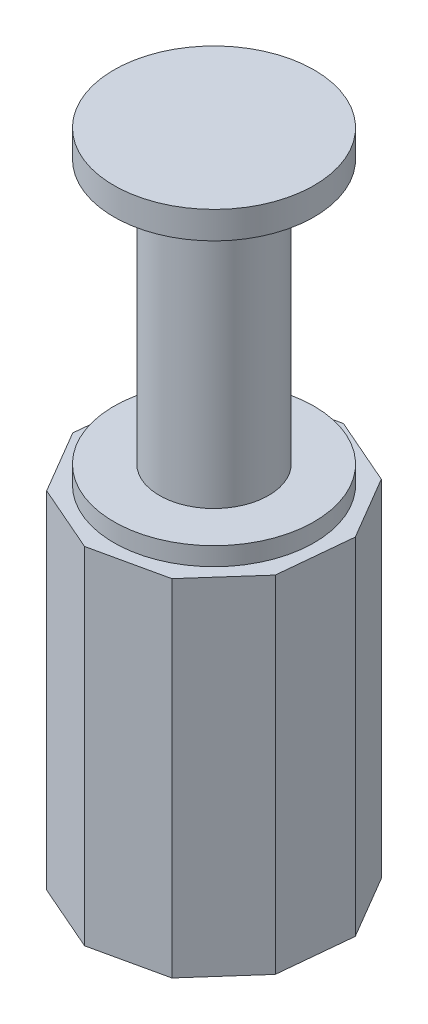
ISO-10303-21;
HEADER;
FILE_DESCRIPTION(('STEP AP214'),'2;1');
FILE_NAME('part.step','',(''),(''),'','','');
FILE_SCHEMA(('AUTOMOTIVE_DESIGN { 1 0 10303 214 1 1 1 1 }'));
ENDSEC;
DATA;
#1=APPLICATION_CONTEXT('core data for automotive mechanical design processes');
#2=APPLICATION_PROTOCOL_DEFINITION('international standard','automotive_design',2000,#1);
#3=PRODUCT_CONTEXT('',#1,'mechanical');
#4=PRODUCT('Part','Part','',(#3));
#5=PRODUCT_RELATED_PRODUCT_CATEGORY('part','',(#4));
#6=PRODUCT_DEFINITION_FORMATION('','',#4);
#7=PRODUCT_DEFINITION_CONTEXT('part definition',#1,'design');
#8=PRODUCT_DEFINITION('design','',#6,#7);
#9=PRODUCT_DEFINITION_SHAPE('','',#8);
#10=(LENGTH_UNIT() NAMED_UNIT(*) SI_UNIT(.MILLI.,.METRE.));
#11=(NAMED_UNIT(*) PLANE_ANGLE_UNIT() SI_UNIT($,.RADIAN.));
#12=(NAMED_UNIT(*) SI_UNIT($,.STERADIAN.) SOLID_ANGLE_UNIT());
#13=UNCERTAINTY_MEASURE_WITH_UNIT(LENGTH_MEASURE(1.E-05),#10,'distance_accuracy_value','');
#14=(GEOMETRIC_REPRESENTATION_CONTEXT(3) GLOBAL_UNCERTAINTY_ASSIGNED_CONTEXT((#13)) GLOBAL_UNIT_ASSIGNED_CONTEXT((#10,
#11,#12)) REPRESENTATION_CONTEXT('',''));
#15=CARTESIAN_POINT('',(0.,0.,0.));
#16=DIRECTION('',(0.,0.,1.));
#17=DIRECTION('',(1.,0.,0.));
#18=AXIS2_PLACEMENT_3D('',#15,#16,#17);
#19=CARTESIAN_POINT('',(0.,-61.7011854285916,0.));
#20=DIRECTION('',(0.,-1.,0.));
#21=DIRECTION('',(0.,0.,-1.));
#22=AXIS2_PLACEMENT_3D('',#19,#20,#21);
#23=CYLINDRICAL_SURFACE('',#22,55.);
#24=CARTESIAN_POINT('',(0.,9.99999999999999,0.));
#25=DIRECTION('',(0.,-1.,0.));
#26=DIRECTION('',(0.,0.,-1.));
#27=AXIS2_PLACEMENT_3D('',#24,#25,#26);
#28=CIRCLE('',#27,55.);
#29=CARTESIAN_POINT('',(0.,9.99999999999999,-55.));
#30=VERTEX_POINT('',#29);
#31=EDGE_CURVE('E44',#30,#30,#28,.T.);
#32=ORIENTED_EDGE('',*,*,#31,.T.);
#33=EDGE_LOOP('',(#32));
#34=FACE_BOUND('',#33,.T.);
#35=CARTESIAN_POINT('',(0.,0.,0.));
#36=DIRECTION('',(0.,-1.,0.));
#37=DIRECTION('',(0.,0.,-1.));
#38=AXIS2_PLACEMENT_3D('',#35,#36,#37);
#39=CIRCLE('',#38,55.);
#40=CARTESIAN_POINT('',(0.,0.,-55.));
#41=VERTEX_POINT('',#40);
#42=EDGE_CURVE('E11',#41,#41,#39,.T.);
#43=ORIENTED_EDGE('',*,*,#42,.F.);
#44=EDGE_LOOP('',(#43));
#45=FACE_BOUND('',#44,.T.);
#46=ADVANCED_FACE('F36',(#34,#45),#23,.T.);
#47=CARTESIAN_POINT('',(0.,10.,-55.));
#48=DIRECTION('',(0.,1.,0.));
#49=DIRECTION('',(0.,0.,1.));
#50=AXIS2_PLACEMENT_3D('',#47,#48,#49);
#51=PLANE('',#50);
#52=CARTESIAN_POINT('',(0.,9.99999999999999,0.));
#53=DIRECTION('',(0.,-1.,0.));
#54=DIRECTION('',(0.,0.,-1.));
#55=AXIS2_PLACEMENT_3D('',#52,#53,#54);
#56=CIRCLE('',#55,30.);
#57=CARTESIAN_POINT('',(0.,9.99999999999999,-30.));
#58=VERTEX_POINT('',#57);
#59=EDGE_CURVE('E193',#58,#58,#56,.T.);
#60=ORIENTED_EDGE('',*,*,#59,.T.);
#61=EDGE_LOOP('',(#60));
#62=FACE_BOUND('',#61,.T.);
#63=ORIENTED_EDGE('',*,*,#31,.F.);
#64=EDGE_LOOP('',(#63));
#65=FACE_BOUND('',#64,.T.);
#66=ADVANCED_FACE('F200',(#62,#65),#51,.T.);
#67=CARTESIAN_POINT('',(0.,-61.7011854285916,0.));
#68=DIRECTION('',(0.,-1.,0.));
#69=DIRECTION('',(0.,0.,-1.));
#70=AXIS2_PLACEMENT_3D('',#67,#68,#69);
#71=CYLINDRICAL_SURFACE('',#70,30.);
#72=CARTESIAN_POINT('',(0.,155.,0.));
#73=DIRECTION('',(0.,-1.,0.));
#74=DIRECTION('',(0.,0.,-1.));
#75=AXIS2_PLACEMENT_3D('',#72,#73,#74);
#76=CIRCLE('',#75,30.);
#77=CARTESIAN_POINT('',(0.,155.,-30.));
#78=VERTEX_POINT('',#77);
#79=EDGE_CURVE('E190',#78,#78,#76,.T.);
#80=ORIENTED_EDGE('',*,*,#79,.T.);
#81=EDGE_LOOP('',(#80));
#82=FACE_BOUND('',#81,.T.);
#83=ORIENTED_EDGE('',*,*,#59,.F.);
#84=EDGE_LOOP('',(#83));
#85=FACE_BOUND('',#84,.T.);
#86=ADVANCED_FACE('F202',(#82,#85),#71,.T.);
#87=CARTESIAN_POINT('',(0.,155.,-30.));
#88=DIRECTION('',(0.,-1.,0.));
#89=DIRECTION('',(0.,0.,-1.));
#90=AXIS2_PLACEMENT_3D('',#87,#88,#89);
#91=PLANE('',#90);
#92=CARTESIAN_POINT('',(0.,155.,0.));
#93=DIRECTION('',(0.,-1.,0.));
#94=DIRECTION('',(0.,0.,-1.));
#95=AXIS2_PLACEMENT_3D('',#92,#93,#94);
#96=CIRCLE('',#95,55.);
#97=CARTESIAN_POINT('',(0.,155.,-55.));
#98=VERTEX_POINT('',#97);
#99=EDGE_CURVE('E187',#98,#98,#96,.T.);
#100=ORIENTED_EDGE('',*,*,#99,.T.);
#101=EDGE_LOOP('',(#100));
#102=FACE_BOUND('',#101,.T.);
#103=ORIENTED_EDGE('',*,*,#79,.F.);
#104=EDGE_LOOP('',(#103));
#105=FACE_BOUND('',#104,.T.);
#106=ADVANCED_FACE('F208',(#102,#105),#91,.T.);
#107=CARTESIAN_POINT('',(0.,-61.7011854285916,0.));
#108=DIRECTION('',(0.,-1.,0.));
#109=DIRECTION('',(0.,0.,-1.));
#110=AXIS2_PLACEMENT_3D('',#107,#108,#109);
#111=CYLINDRICAL_SURFACE('',#110,55.);
#112=CARTESIAN_POINT('',(0.,170.,0.));
#113=DIRECTION('',(0.,-1.,0.));
#114=DIRECTION('',(0.,0.,-1.));
#115=AXIS2_PLACEMENT_3D('',#112,#113,#114);
#116=CIRCLE('',#115,55.);
#117=CARTESIAN_POINT('',(0.,170.,-55.));
#118=VERTEX_POINT('',#117);
#119=EDGE_CURVE('E184',#118,#118,#116,.T.);
#120=ORIENTED_EDGE('',*,*,#119,.T.);
#121=EDGE_LOOP('',(#120));
#122=FACE_BOUND('',#121,.T.);
#123=ORIENTED_EDGE('',*,*,#99,.F.);
#124=EDGE_LOOP('',(#123));
#125=FACE_BOUND('',#124,.T.);
#126=ADVANCED_FACE('F214',(#122,#125),#111,.T.);
#127=CARTESIAN_POINT('',(0.,170.,-55.));
#128=DIRECTION('',(0.,1.,0.));
#129=DIRECTION('',(0.,0.,1.));
#130=AXIS2_PLACEMENT_3D('',#127,#128,#129);
#131=PLANE('',#130);
#132=ORIENTED_EDGE('',*,*,#119,.F.);
#133=EDGE_LOOP('',(#132));
#134=FACE_BOUND('',#133,.T.);
#135=ADVANCED_FACE('F218',(#134),#131,.T.);
#136=CARTESIAN_POINT('',(63.5797171035183,-190.,-14.0255086317062));
#137=DIRECTION('',(-0.995295372339364,0.,-0.0968871601392408));
#138=DIRECTION('',(-0.0968871601392408,0.,0.995295372339364));
#139=AXIS2_PLACEMENT_3D('',#136,#137,#138);
#140=PLANE('',#139);
#141=DIRECTION('',(-0.0968871601392408,0.,0.995295372339364));
#142=VECTOR('',#141,1.);
#143=CARTESIAN_POINT('',(63.5797171035183,0.,-14.0255086317062));
#144=LINE('',#143,#142);
#145=CARTESIAN_POINT('',(63.5797171035183,0.,-14.0255086317062));
#146=VERTEX_POINT('',#145);
#147=CARTESIAN_POINT('',(59.6810587639155,0.,26.0243452205728));
#148=VERTEX_POINT('',#147);
#149=EDGE_CURVE('E145',#146,#148,#144,.T.);
#150=ORIENTED_EDGE('',*,*,#149,.T.);
#151=DIRECTION('',(0.,1.,0.));
#152=VECTOR('',#151,1.);
#153=CARTESIAN_POINT('',(59.6810587639155,-190.,26.0243452205728));
#154=LINE('',#153,#152);
#155=CARTESIAN_POINT('',(59.6810587639155,-190.,26.0243452205728));
#156=VERTEX_POINT('',#155);
#157=EDGE_CURVE('E182',#156,#148,#154,.T.);
#158=ORIENTED_EDGE('',*,*,#157,.F.);
#159=DIRECTION('',(-0.0968871601392408,0.,0.995295372339364));
#160=VECTOR('',#159,1.);
#161=CARTESIAN_POINT('',(63.5797171035183,-190.,-14.0255086317062));
#162=LINE('',#161,#160);
#163=CARTESIAN_POINT('',(63.5797171035183,-190.,-14.0255086317062));
#164=VERTEX_POINT('',#163);
#165=EDGE_CURVE('E163',#164,#156,#162,.T.);
#166=ORIENTED_EDGE('',*,*,#165,.F.);
#167=DIRECTION('',(0.,1.,0.));
#168=VECTOR('',#167,1.);
#169=CARTESIAN_POINT('',(63.5797171035183,-190.,-14.0255086317062));
#170=LINE('',#169,#168);
#171=EDGE_CURVE('E141',#164,#146,#170,.T.);
#172=ORIENTED_EDGE('',*,*,#171,.T.);
#173=EDGE_LOOP('',(#150,#158,#166,#172));
#174=FACE_BOUND('',#173,.T.);
#175=ADVANCED_FACE('F222',(#174),#140,.F.);
#176=CARTESIAN_POINT('',(59.6810587639155,-190.,26.0243452205728));
#177=DIRECTION('',(-0.748262026778941,0.,-0.663403300625397));
#178=DIRECTION('',(-0.663403300625397,0.,0.748262026778941));
#179=AXIS2_PLACEMENT_3D('',#176,#177,#178);
#180=PLANE('',#179);
#181=DIRECTION('',(-0.663403300625397,0.,0.748262026778941));
#182=VECTOR('',#181,1.);
#183=CARTESIAN_POINT('',(59.6810587639155,0.,26.0243452205728));
#184=LINE('',#183,#182);
#185=CARTESIAN_POINT('',(32.9862644610768,0.,56.1337837335538));
#186=VERTEX_POINT('',#185);
#187=EDGE_CURVE('E148',#148,#186,#184,.T.);
#188=ORIENTED_EDGE('',*,*,#187,.T.);
#189=DIRECTION('',(0.,1.,0.));
#190=VECTOR('',#189,1.);
#191=CARTESIAN_POINT('',(32.9862644610768,-190.,56.1337837335538));
#192=LINE('',#191,#190);
#193=CARTESIAN_POINT('',(32.9862644610768,-190.,56.1337837335538));
#194=VERTEX_POINT('',#193);
#195=EDGE_CURVE('E179',#194,#186,#192,.T.);
#196=ORIENTED_EDGE('',*,*,#195,.F.);
#197=DIRECTION('',(-0.663403300625397,0.,0.748262026778941));
#198=VECTOR('',#197,1.);
#199=CARTESIAN_POINT('',(59.6810587639155,-190.,26.0243452205728));
#200=LINE('',#199,#198);
#201=EDGE_CURVE('E102',#156,#194,#200,.T.);
#202=ORIENTED_EDGE('',*,*,#201,.F.);
#203=ORIENTED_EDGE('',*,*,#157,.T.);
#204=EDGE_LOOP('',(#188,#196,#202,#203));
#205=FACE_BOUND('',#204,.T.);
#206=ADVANCED_FACE('F226',(#205),#180,.F.);
#207=CARTESIAN_POINT('',(32.9862644610768,-190.,56.1337837335538));
#208=DIRECTION('',(-0.215418019479847,0.,-0.976521928521516));
#209=DIRECTION('',(-0.976521928521516,0.,0.215418019479847));
#210=AXIS2_PLACEMENT_3D('',#207,#208,#209);
#211=PLANE('',#210);
#212=DIRECTION('',(-0.976521928521516,0.,0.215418019479847));
#213=VECTOR('',#212,1.);
#214=CARTESIAN_POINT('',(32.9862644610768,0.,56.1337837335538));
#215=LINE('',#214,#213);
#216=CARTESIAN_POINT('',(-6.30816170400058,0.,64.8020247774532));
#217=VERTEX_POINT('',#216);
#218=EDGE_CURVE('E150',#186,#217,#215,.T.);
#219=ORIENTED_EDGE('',*,*,#218,.T.);
#220=DIRECTION('',(0.,1.,0.));
#221=VECTOR('',#220,1.);
#222=CARTESIAN_POINT('',(-6.30816170400058,-190.,64.8020247774532));
#223=LINE('',#222,#221);
#224=CARTESIAN_POINT('',(-6.30816170400058,-190.,64.8020247774532));
#225=VERTEX_POINT('',#224);
#226=EDGE_CURVE('E176',#225,#217,#223,.T.);
#227=ORIENTED_EDGE('',*,*,#226,.F.);
#228=DIRECTION('',(-0.976521928521516,0.,0.215418019479847));
#229=VECTOR('',#228,1.);
#230=CARTESIAN_POINT('',(32.9862644610768,-190.,56.1337837335538));
#231=LINE('',#230,#229);
#232=EDGE_CURVE('E377',#194,#225,#231,.T.);
#233=ORIENTED_EDGE('',*,*,#232,.F.);
#234=ORIENTED_EDGE('',*,*,#195,.T.);
#235=EDGE_LOOP('',(#219,#227,#233,#234));
#236=FACE_BOUND('',#235,.T.);
#237=ADVANCED_FACE('F230',(#236),#211,.F.);
#238=CARTESIAN_POINT('',(-6.30816170400058,-190.,64.8020247774532));
#239=DIRECTION('',(0.399708349471362,0.,-0.916642370482011));
#240=DIRECTION('',(-0.916642370482011,0.,-0.399708349471362));
#241=AXIS2_PLACEMENT_3D('',#238,#239,#240);
#242=PLANE('',#241);
#243=DIRECTION('',(-0.916642370482011,0.,-0.399708349471362));
#244=VECTOR('',#243,1.);
#245=CARTESIAN_POINT('',(-6.30816170400058,0.,64.8020247774532));
#246=LINE('',#245,#244);
#247=CARTESIAN_POINT('',(-43.1930845046801,0.,48.7180948961784));
#248=VERTEX_POINT('',#247);
#249=EDGE_CURVE('E152',#217,#248,#246,.T.);
#250=ORIENTED_EDGE('',*,*,#249,.T.);
#251=DIRECTION('',(0.,1.,0.));
#252=VECTOR('',#251,1.);
#253=CARTESIAN_POINT('',(-43.1930845046801,-190.,48.7180948961784));
#254=LINE('',#253,#252);
#255=CARTESIAN_POINT('',(-43.1930845046801,-190.,48.7180948961784));
#256=VERTEX_POINT('',#255);
#257=EDGE_CURVE('E173',#256,#248,#254,.T.);
#258=ORIENTED_EDGE('',*,*,#257,.F.);
#259=DIRECTION('',(-0.916642370482011,0.,-0.399708349471362));
#260=VECTOR('',#259,1.);
#261=CARTESIAN_POINT('',(-6.30816170400058,-190.,64.8020247774532));
#262=LINE('',#261,#260);
#263=EDGE_CURVE('E381',#225,#256,#262,.T.);
#264=ORIENTED_EDGE('',*,*,#263,.F.);
#265=ORIENTED_EDGE('',*,*,#226,.T.);
#266=EDGE_LOOP('',(#250,#258,#264,#265));
#267=FACE_BOUND('',#266,.T.);
#268=ADVANCED_FACE('F233',(#267),#242,.F.);
#269=CARTESIAN_POINT('',(-43.1930845046801,-190.,48.7180948961784));
#270=DIRECTION('',(0.862159714511631,0.,-0.506636582446651));
#271=DIRECTION('',(-0.506636582446651,0.,-0.862159714511631));
#272=AXIS2_PLACEMENT_3D('',#269,#270,#271);
#273=PLANE('',#272);
#274=DIRECTION('',(-0.506636582446651,0.,-0.862159714511632));
#275=VECTOR('',#274,1.);
#276=CARTESIAN_POINT('',(-43.1930845046801,0.,48.7180948961784));
#277=LINE('',#276,#275);
#278=CARTESIAN_POINT('',(-63.5797171035183,0.,14.0255086317062));
#279=VERTEX_POINT('',#278);
#280=EDGE_CURVE('E154',#248,#279,#277,.T.);
#281=ORIENTED_EDGE('',*,*,#280,.T.);
#282=DIRECTION('',(0.,1.,0.));
#283=VECTOR('',#282,1.);
#284=CARTESIAN_POINT('',(-63.5797171035183,-190.,14.0255086317062));
#285=LINE('',#284,#283);
#286=CARTESIAN_POINT('',(-63.5797171035183,-190.,14.0255086317062));
#287=VERTEX_POINT('',#286);
#288=EDGE_CURVE('E170',#287,#279,#285,.T.);
#289=ORIENTED_EDGE('',*,*,#288,.F.);
#290=DIRECTION('',(-0.506636582446651,0.,-0.862159714511632));
#291=VECTOR('',#290,1.);
#292=CARTESIAN_POINT('',(-43.1930845046801,-190.,48.7180948961784));
#293=LINE('',#292,#291);
#294=EDGE_CURVE('E383',#256,#287,#293,.T.);
#295=ORIENTED_EDGE('',*,*,#294,.F.);
#296=ORIENTED_EDGE('',*,*,#257,.T.);
#297=EDGE_LOOP('',(#281,#289,#295,#296));
#298=FACE_BOUND('',#297,.T.);
#299=ADVANCED_FACE('F237',(#298),#273,.F.);
#300=CARTESIAN_POINT('',(-63.5797171035183,-190.,14.0255086317062));
#301=DIRECTION('',(0.995295372339364,0.,0.0968871601392407));
#302=DIRECTION('',(0.0968871601392407,0.,-0.995295372339364));
#303=AXIS2_PLACEMENT_3D('',#300,#301,#302);
#304=PLANE('',#303);
#305=DIRECTION('',(0.0968871601392407,0.,-0.995295372339364));
#306=VECTOR('',#305,1.);
#307=CARTESIAN_POINT('',(-63.5797171035183,0.,14.0255086317062));
#308=LINE('',#307,#306);
#309=CARTESIAN_POINT('',(-59.6810587639155,0.,-26.0243452205727));
#310=VERTEX_POINT('',#309);
#311=EDGE_CURVE('E156',#279,#310,#308,.T.);
#312=ORIENTED_EDGE('',*,*,#311,.T.);
#313=DIRECTION('',(0.,1.,0.));
#314=VECTOR('',#313,1.);
#315=CARTESIAN_POINT('',(-59.6810587639155,-190.,-26.0243452205727));
#316=LINE('',#315,#314);
#317=CARTESIAN_POINT('',(-59.6810587639155,-190.,-26.0243452205727));
#318=VERTEX_POINT('',#317);
#319=EDGE_CURVE('E167',#318,#310,#316,.T.);
#320=ORIENTED_EDGE('',*,*,#319,.F.);
#321=DIRECTION('',(0.0968871601392407,0.,-0.995295372339364));
#322=VECTOR('',#321,1.);
#323=CARTESIAN_POINT('',(-63.5797171035183,-190.,14.0255086317062));
#324=LINE('',#323,#322);
#325=EDGE_CURVE('E385',#287,#318,#324,.T.);
#326=ORIENTED_EDGE('',*,*,#325,.F.);
#327=ORIENTED_EDGE('',*,*,#288,.T.);
#328=EDGE_LOOP('',(#312,#320,#326,#327));
#329=FACE_BOUND('',#328,.T.);
#330=ADVANCED_FACE('F241',(#329),#304,.F.);
#331=CARTESIAN_POINT('',(-59.6810587639155,-190.,-26.0243452205727));
#332=DIRECTION('',(0.748262026778941,0.,0.663403300625397));
#333=DIRECTION('',(0.663403300625397,0.,-0.748262026778941));
#334=AXIS2_PLACEMENT_3D('',#331,#332,#333);
#335=PLANE('',#334);
#336=DIRECTION('',(0.663403300625397,0.,-0.748262026778941));
#337=VECTOR('',#336,1.);
#338=CARTESIAN_POINT('',(-59.6810587639155,0.,-26.0243452205727));
#339=LINE('',#338,#337);
#340=CARTESIAN_POINT('',(-32.9862644610767,0.,-56.1337837335538));
#341=VERTEX_POINT('',#340);
#342=EDGE_CURVE('E158',#310,#341,#339,.T.);
#343=ORIENTED_EDGE('',*,*,#342,.T.);
#344=DIRECTION('',(0.,1.,0.));
#345=VECTOR('',#344,1.);
#346=CARTESIAN_POINT('',(-32.9862644610767,-190.,-56.1337837335538));
#347=LINE('',#346,#345);
#348=CARTESIAN_POINT('',(-32.9862644610767,-190.,-56.1337837335538));
#349=VERTEX_POINT('',#348);
#350=EDGE_CURVE('E136',#349,#341,#347,.T.);
#351=ORIENTED_EDGE('',*,*,#350,.F.);
#352=DIRECTION('',(0.663403300625397,0.,-0.748262026778941));
#353=VECTOR('',#352,1.);
#354=CARTESIAN_POINT('',(-59.6810587639155,-190.,-26.0243452205727));
#355=LINE('',#354,#353);
#356=EDGE_CURVE('E127',#318,#349,#355,.T.);
#357=ORIENTED_EDGE('',*,*,#356,.F.);
#358=ORIENTED_EDGE('',*,*,#319,.T.);
#359=EDGE_LOOP('',(#343,#351,#357,#358));
#360=FACE_BOUND('',#359,.T.);
#361=ADVANCED_FACE('F245',(#360),#335,.F.);
#362=CARTESIAN_POINT('',(-32.9862644610767,-190.,-56.1337837335538));
#363=DIRECTION('',(0.215418019479847,0.,0.976521928521516));
#364=DIRECTION('',(0.976521928521516,0.,-0.215418019479847));
#365=AXIS2_PLACEMENT_3D('',#362,#363,#364);
#366=PLANE('',#365);
#367=DIRECTION('',(0.976521928521516,0.,-0.215418019479847));
#368=VECTOR('',#367,1.);
#369=CARTESIAN_POINT('',(-32.9862644610767,0.,-56.1337837335538));
#370=LINE('',#369,#368);
#371=CARTESIAN_POINT('',(6.30816170400057,0.,-64.8020247774532));
#372=VERTEX_POINT('',#371);
#373=EDGE_CURVE('E135',#341,#372,#370,.T.);
#374=ORIENTED_EDGE('',*,*,#373,.T.);
#375=DIRECTION('',(0.,1.,0.));
#376=VECTOR('',#375,1.);
#377=CARTESIAN_POINT('',(6.30816170400057,-190.,-64.8020247774532));
#378=LINE('',#377,#376);
#379=CARTESIAN_POINT('',(6.30816170400057,-190.,-64.8020247774532));
#380=VERTEX_POINT('',#379);
#381=EDGE_CURVE('E132',#380,#372,#378,.T.);
#382=ORIENTED_EDGE('',*,*,#381,.F.);
#383=DIRECTION('',(0.976521928521516,0.,-0.215418019479847));
#384=VECTOR('',#383,1.);
#385=CARTESIAN_POINT('',(-32.9862644610767,-190.,-56.1337837335538));
#386=LINE('',#385,#384);
#387=EDGE_CURVE('E121',#349,#380,#386,.T.);
#388=ORIENTED_EDGE('',*,*,#387,.F.);
#389=ORIENTED_EDGE('',*,*,#350,.T.);
#390=EDGE_LOOP('',(#374,#382,#388,#389));
#391=FACE_BOUND('',#390,.T.);
#392=ADVANCED_FACE('F133',(#391),#366,.F.);
#393=CARTESIAN_POINT('',(6.30816170400057,-190.,-64.8020247774532));
#394=DIRECTION('',(-0.399708349471362,0.,0.916642370482011));
#395=DIRECTION('',(0.916642370482011,0.,0.399708349471362));
#396=AXIS2_PLACEMENT_3D('',#393,#394,#395);
#397=PLANE('',#396);
#398=DIRECTION('',(0.916642370482011,0.,0.399708349471362));
#399=VECTOR('',#398,1.);
#400=CARTESIAN_POINT('',(6.30816170400057,0.,-64.8020247774532));
#401=LINE('',#400,#399);
#402=CARTESIAN_POINT('',(43.1930845046801,0.,-48.7180948961784));
#403=VERTEX_POINT('',#402);
#404=EDGE_CURVE('E87',#372,#403,#401,.T.);
#405=ORIENTED_EDGE('',*,*,#404,.T.);
#406=DIRECTION('',(0.,1.,0.));
#407=VECTOR('',#406,1.);
#408=CARTESIAN_POINT('',(43.1930845046801,-190.,-48.7180948961784));
#409=LINE('',#408,#407);
#410=CARTESIAN_POINT('',(43.1930845046801,-190.,-48.7180948961784));
#411=VERTEX_POINT('',#410);
#412=EDGE_CURVE('E137',#411,#403,#409,.T.);
#413=ORIENTED_EDGE('',*,*,#412,.F.);
#414=DIRECTION('',(0.916642370482011,0.,0.399708349471362));
#415=VECTOR('',#414,1.);
#416=CARTESIAN_POINT('',(6.30816170400057,-190.,-64.8020247774532));
#417=LINE('',#416,#415);
#418=EDGE_CURVE('E125',#380,#411,#417,.T.);
#419=ORIENTED_EDGE('',*,*,#418,.F.);
#420=ORIENTED_EDGE('',*,*,#381,.T.);
#421=EDGE_LOOP('',(#405,#413,#419,#420));
#422=FACE_BOUND('',#421,.T.);
#423=ADVANCED_FACE('F139',(#422),#397,.F.);
#424=CARTESIAN_POINT('',(43.1930845046801,-190.,-48.7180948961784));
#425=DIRECTION('',(-0.862159714511631,0.,0.506636582446651));
#426=DIRECTION('',(0.506636582446651,0.,0.862159714511631));
#427=AXIS2_PLACEMENT_3D('',#424,#425,#426);
#428=PLANE('',#427);
#429=DIRECTION('',(0.506636582446651,0.,0.862159714511631));
#430=VECTOR('',#429,1.);
#431=CARTESIAN_POINT('',(43.1930845046801,0.,-48.7180948961784));
#432=LINE('',#431,#430);
#433=EDGE_CURVE('E93',#403,#146,#432,.T.);
#434=ORIENTED_EDGE('',*,*,#433,.T.);
#435=ORIENTED_EDGE('',*,*,#171,.F.);
#436=DIRECTION('',(0.506636582446651,0.,0.862159714511631));
#437=VECTOR('',#436,1.);
#438=CARTESIAN_POINT('',(43.1930845046801,-190.,-48.7180948961784));
#439=LINE('',#438,#437);
#440=EDGE_CURVE('E52',#411,#164,#439,.T.);
#441=ORIENTED_EDGE('',*,*,#440,.F.);
#442=ORIENTED_EDGE('',*,*,#412,.T.);
#443=EDGE_LOOP('',(#434,#435,#441,#442));
#444=FACE_BOUND('',#443,.T.);
#445=ADVANCED_FACE('F254',(#444),#428,.F.);
#446=CARTESIAN_POINT('',(0.,-190.,0.));
#447=DIRECTION('',(0.,-1.,0.));
#448=DIRECTION('',(0.,0.,-1.));
#449=AXIS2_PLACEMENT_3D('',#446,#447,#448);
#450=PLANE('',#449);
#451=ORIENTED_EDGE('',*,*,#165,.T.);
#452=ORIENTED_EDGE('',*,*,#201,.T.);
#453=ORIENTED_EDGE('',*,*,#232,.T.);
#454=ORIENTED_EDGE('',*,*,#263,.T.);
#455=ORIENTED_EDGE('',*,*,#294,.T.);
#456=ORIENTED_EDGE('',*,*,#325,.T.);
#457=ORIENTED_EDGE('',*,*,#356,.T.);
#458=ORIENTED_EDGE('',*,*,#387,.T.);
#459=ORIENTED_EDGE('',*,*,#418,.T.);
#460=ORIENTED_EDGE('',*,*,#440,.T.);
#461=EDGE_LOOP('',(#451,#452,#453,#454,#455,#456,#457,#458,#459,#460));
#462=FACE_BOUND('',#461,.T.);
#463=ADVANCED_FACE('F123',(#462),#450,.T.);
#464=CARTESIAN_POINT('',(0.,0.,0.));
#465=DIRECTION('',(0.,-1.,0.));
#466=DIRECTION('',(0.,0.,-1.));
#467=AXIS2_PLACEMENT_3D('',#464,#465,#466);
#468=PLANE('',#467);
#469=ORIENTED_EDGE('',*,*,#42,.T.);
#470=EDGE_LOOP('',(#469));
#471=FACE_BOUND('',#470,.T.);
#472=ORIENTED_EDGE('',*,*,#149,.F.);
#473=ORIENTED_EDGE('',*,*,#433,.F.);
#474=ORIENTED_EDGE('',*,*,#404,.F.);
#475=ORIENTED_EDGE('',*,*,#373,.F.);
#476=ORIENTED_EDGE('',*,*,#342,.F.);
#477=ORIENTED_EDGE('',*,*,#311,.F.);
#478=ORIENTED_EDGE('',*,*,#280,.F.);
#479=ORIENTED_EDGE('',*,*,#249,.F.);
#480=ORIENTED_EDGE('',*,*,#218,.F.);
#481=ORIENTED_EDGE('',*,*,#187,.F.);
#482=EDGE_LOOP('',(#472,#473,#474,#475,#476,#477,#478,#479,#480,#481));
#483=FACE_BOUND('',#482,.T.);
#484=ADVANCED_FACE('F257',(#471,#483),#468,.F.);
#485=CLOSED_SHELL('',(#46,#66,#86,#106,#126,#135,#175,#206,#237,#268,#299,#330,#361,#392,#423,
#445,#463,#484));
#486=MANIFOLD_SOLID_BREP('B2',#485);
#487=ADVANCED_BREP_SHAPE_REPRESENTATION('',(#18,#486),#14);
#488=SHAPE_DEFINITION_REPRESENTATION(#9,#487);
ENDSEC;
END-ISO-10303-21;
